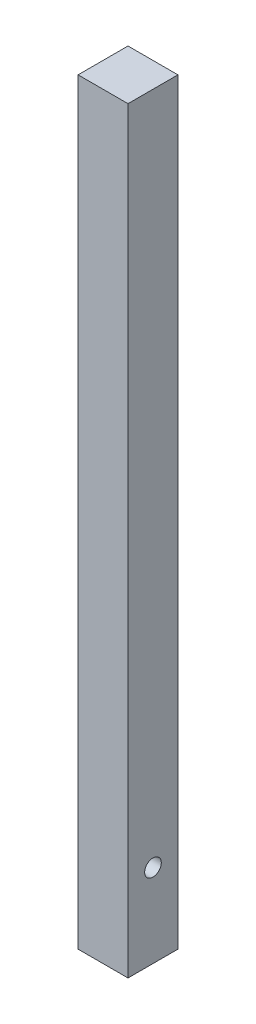
ISO-10303-21;
HEADER;
FILE_DESCRIPTION(('STEP AP214'),'2;1');
FILE_NAME('part.step','',(''),(''),'','','');
FILE_SCHEMA(('AUTOMOTIVE_DESIGN { 1 0 10303 214 1 1 1 1 }'));
ENDSEC;
DATA;
#1=APPLICATION_CONTEXT('core data for automotive mechanical design processes');
#2=APPLICATION_PROTOCOL_DEFINITION('international standard','automotive_design',2000,#1);
#3=PRODUCT_CONTEXT('',#1,'mechanical');
#4=PRODUCT('Part','Part','',(#3));
#5=PRODUCT_RELATED_PRODUCT_CATEGORY('part','',(#4));
#6=PRODUCT_DEFINITION_FORMATION('','',#4);
#7=PRODUCT_DEFINITION_CONTEXT('part definition',#1,'design');
#8=PRODUCT_DEFINITION('design','',#6,#7);
#9=PRODUCT_DEFINITION_SHAPE('','',#8);
#10=(LENGTH_UNIT() NAMED_UNIT(*) SI_UNIT(.MILLI.,.METRE.));
#11=(NAMED_UNIT(*) PLANE_ANGLE_UNIT() SI_UNIT($,.RADIAN.));
#12=(NAMED_UNIT(*) SI_UNIT($,.STERADIAN.) SOLID_ANGLE_UNIT());
#13=UNCERTAINTY_MEASURE_WITH_UNIT(LENGTH_MEASURE(1.E-05),#10,'distance_accuracy_value','');
#14=(GEOMETRIC_REPRESENTATION_CONTEXT(3) GLOBAL_UNCERTAINTY_ASSIGNED_CONTEXT((#13)) GLOBAL_UNIT_ASSIGNED_CONTEXT((#10,
#11,#12)) REPRESENTATION_CONTEXT('',''));
#15=CARTESIAN_POINT('',(0.,0.,0.));
#16=DIRECTION('',(0.,0.,1.));
#17=DIRECTION('',(1.,0.,0.));
#18=AXIS2_PLACEMENT_3D('',#15,#16,#17);
#19=CARTESIAN_POINT('',(19.05,577.85,-19.05));
#20=DIRECTION('',(-1.,0.,0.));
#21=DIRECTION('',(0.,0.,1.));
#22=AXIS2_PLACEMENT_3D('',#19,#20,#21);
#23=PLANE('',#22);
#24=CARTESIAN_POINT('',(19.05,63.5,0.));
#25=DIRECTION('',(1.,0.,0.));
#26=DIRECTION('',(0.,0.,-1.));
#27=AXIS2_PLACEMENT_3D('',#24,#25,#26);
#28=CIRCLE('',#27,6.35);
#29=CARTESIAN_POINT('',(19.05,63.5,-6.35));
#30=VERTEX_POINT('',#29);
#31=EDGE_CURVE('E109',#30,#30,#28,.T.);
#32=ORIENTED_EDGE('',*,*,#31,.F.);
#33=EDGE_LOOP('',(#32));
#34=FACE_BOUND('',#33,.T.);
#35=DIRECTION('',(0.,0.,-1.));
#36=VECTOR('',#35,1.);
#37=CARTESIAN_POINT('',(19.05,0.,-19.05));
#38=LINE('',#37,#36);
#39=CARTESIAN_POINT('',(19.05,0.,19.05));
#40=VERTEX_POINT('',#39);
#41=CARTESIAN_POINT('',(19.05,0.,-19.05));
#42=VERTEX_POINT('',#41);
#43=EDGE_CURVE('E95',#40,#42,#38,.T.);
#44=ORIENTED_EDGE('',*,*,#43,.T.);
#45=DIRECTION('',(0.,-1.,0.));
#46=VECTOR('',#45,1.);
#47=CARTESIAN_POINT('',(19.05,577.85,-19.05));
#48=LINE('',#47,#46);
#49=CARTESIAN_POINT('',(19.05,577.85,-19.05));
#50=VERTEX_POINT('',#49);
#51=EDGE_CURVE('E11',#50,#42,#48,.T.);
#52=ORIENTED_EDGE('',*,*,#51,.F.);
#53=DIRECTION('',(0.,0.,-1.));
#54=VECTOR('',#53,1.);
#55=CARTESIAN_POINT('',(19.05,577.85,-19.05));
#56=LINE('',#55,#54);
#57=CARTESIAN_POINT('',(19.05,577.85,19.05));
#58=VERTEX_POINT('',#57);
#59=EDGE_CURVE('E83',#58,#50,#56,.T.);
#60=ORIENTED_EDGE('',*,*,#59,.F.);
#61=DIRECTION('',(0.,-1.,0.));
#62=VECTOR('',#61,1.);
#63=CARTESIAN_POINT('',(19.05,577.85,19.05));
#64=LINE('',#63,#62);
#65=EDGE_CURVE('E91',#58,#40,#64,.T.);
#66=ORIENTED_EDGE('',*,*,#65,.T.);
#67=EDGE_LOOP('',(#44,#52,#60,#66));
#68=FACE_BOUND('',#67,.T.);
#69=ADVANCED_FACE('F32',(#34,#68),#23,.F.);
#70=CARTESIAN_POINT('',(-19.05,577.85,-19.05));
#71=DIRECTION('',(0.,0.,1.));
#72=DIRECTION('',(1.,0.,0.));
#73=AXIS2_PLACEMENT_3D('',#70,#71,#72);
#74=PLANE('',#73);
#75=CARTESIAN_POINT('',(0.,63.5,-19.05));
#76=DIRECTION('',(0.,0.,-1.));
#77=DIRECTION('',(-1.,0.,0.));
#78=AXIS2_PLACEMENT_3D('',#75,#76,#77);
#79=CIRCLE('',#78,6.35);
#80=CARTESIAN_POINT('',(-6.35,63.5,-19.05));
#81=VERTEX_POINT('',#80);
#82=EDGE_CURVE('E115',#81,#81,#79,.T.);
#83=ORIENTED_EDGE('',*,*,#82,.F.);
#84=EDGE_LOOP('',(#83));
#85=FACE_BOUND('',#84,.T.);
#86=DIRECTION('',(-1.,0.,0.));
#87=VECTOR('',#86,1.);
#88=CARTESIAN_POINT('',(-19.05,0.,-19.05));
#89=LINE('',#88,#87);
#90=CARTESIAN_POINT('',(-19.05,0.,-19.05));
#91=VERTEX_POINT('',#90);
#92=EDGE_CURVE('E87',#42,#91,#89,.T.);
#93=ORIENTED_EDGE('',*,*,#92,.T.);
#94=DIRECTION('',(0.,-1.,0.));
#95=VECTOR('',#94,1.);
#96=CARTESIAN_POINT('',(-19.05,577.85,-19.05));
#97=LINE('',#96,#95);
#98=CARTESIAN_POINT('',(-19.05,577.85,-19.05));
#99=VERTEX_POINT('',#98);
#100=EDGE_CURVE('E40',#99,#91,#97,.T.);
#101=ORIENTED_EDGE('',*,*,#100,.F.);
#102=DIRECTION('',(-1.,0.,0.));
#103=VECTOR('',#102,1.);
#104=CARTESIAN_POINT('',(-19.05,577.85,-19.05));
#105=LINE('',#104,#103);
#106=EDGE_CURVE('E78',#50,#99,#105,.T.);
#107=ORIENTED_EDGE('',*,*,#106,.F.);
#108=ORIENTED_EDGE('',*,*,#51,.T.);
#109=EDGE_LOOP('',(#93,#101,#107,#108));
#110=FACE_BOUND('',#109,.T.);
#111=ADVANCED_FACE('F86',(#85,#110),#74,.F.);
#112=CARTESIAN_POINT('',(-19.05,577.85,-19.05));
#113=DIRECTION('',(1.,0.,0.));
#114=DIRECTION('',(0.,0.,-1.));
#115=AXIS2_PLACEMENT_3D('',#112,#113,#114);
#116=PLANE('',#115);
#117=DIRECTION('',(0.,0.,1.));
#118=VECTOR('',#117,1.);
#119=CARTESIAN_POINT('',(-19.05,0.,-19.05));
#120=LINE('',#119,#118);
#121=CARTESIAN_POINT('',(-19.05,0.,19.05));
#122=VERTEX_POINT('',#121);
#123=EDGE_CURVE('E65',#91,#122,#120,.T.);
#124=ORIENTED_EDGE('',*,*,#123,.T.);
#125=DIRECTION('',(0.,-1.,0.));
#126=VECTOR('',#125,1.);
#127=CARTESIAN_POINT('',(-19.05,577.85,19.05));
#128=LINE('',#127,#126);
#129=CARTESIAN_POINT('',(-19.05,577.85,19.05));
#130=VERTEX_POINT('',#129);
#131=EDGE_CURVE('E88',#130,#122,#128,.T.);
#132=ORIENTED_EDGE('',*,*,#131,.F.);
#133=DIRECTION('',(0.,0.,1.));
#134=VECTOR('',#133,1.);
#135=CARTESIAN_POINT('',(-19.05,577.85,-19.05));
#136=LINE('',#135,#134);
#137=EDGE_CURVE('E81',#99,#130,#136,.T.);
#138=ORIENTED_EDGE('',*,*,#137,.F.);
#139=ORIENTED_EDGE('',*,*,#100,.T.);
#140=EDGE_LOOP('',(#124,#132,#138,#139));
#141=FACE_BOUND('',#140,.T.);
#142=ADVANCED_FACE('F89',(#141),#116,.F.);
#143=CARTESIAN_POINT('',(-19.05,577.85,19.05));
#144=DIRECTION('',(0.,0.,-1.));
#145=DIRECTION('',(-1.,0.,0.));
#146=AXIS2_PLACEMENT_3D('',#143,#144,#145);
#147=PLANE('',#146);
#148=DIRECTION('',(1.,0.,0.));
#149=VECTOR('',#148,1.);
#150=CARTESIAN_POINT('',(-19.05,0.,19.05));
#151=LINE('',#150,#149);
#152=EDGE_CURVE('E71',#122,#40,#151,.T.);
#153=ORIENTED_EDGE('',*,*,#152,.T.);
#154=ORIENTED_EDGE('',*,*,#65,.F.);
#155=DIRECTION('',(1.,0.,0.));
#156=VECTOR('',#155,1.);
#157=CARTESIAN_POINT('',(-19.05,577.85,19.05));
#158=LINE('',#157,#156);
#159=EDGE_CURVE('E48',#130,#58,#158,.T.);
#160=ORIENTED_EDGE('',*,*,#159,.F.);
#161=ORIENTED_EDGE('',*,*,#131,.T.);
#162=EDGE_LOOP('',(#153,#154,#160,#161));
#163=FACE_BOUND('',#162,.T.);
#164=ADVANCED_FACE('F103',(#163),#147,.F.);
#165=CARTESIAN_POINT('',(0.,577.85,0.));
#166=DIRECTION('',(0.,1.,0.));
#167=DIRECTION('',(0.,0.,1.));
#168=AXIS2_PLACEMENT_3D('',#165,#166,#167);
#169=PLANE('',#168);
#170=ORIENTED_EDGE('',*,*,#59,.T.);
#171=ORIENTED_EDGE('',*,*,#106,.T.);
#172=ORIENTED_EDGE('',*,*,#137,.T.);
#173=ORIENTED_EDGE('',*,*,#159,.T.);
#174=EDGE_LOOP('',(#170,#171,#172,#173));
#175=FACE_BOUND('',#174,.T.);
#176=ADVANCED_FACE('F79',(#175),#169,.T.);
#177=CARTESIAN_POINT('',(0.,0.,0.));
#178=DIRECTION('',(0.,1.,0.));
#179=DIRECTION('',(0.,0.,1.));
#180=AXIS2_PLACEMENT_3D('',#177,#178,#179);
#181=PLANE('',#180);
#182=ORIENTED_EDGE('',*,*,#43,.F.);
#183=ORIENTED_EDGE('',*,*,#152,.F.);
#184=ORIENTED_EDGE('',*,*,#123,.F.);
#185=ORIENTED_EDGE('',*,*,#92,.F.);
#186=EDGE_LOOP('',(#182,#183,#184,#185));
#187=FACE_BOUND('',#186,.T.);
#188=ADVANCED_FACE('F106',(#187),#181,.F.);
#189=CARTESIAN_POINT('',(6.35,63.5,0.));
#190=DIRECTION('',(1.,0.,0.));
#191=DIRECTION('',(0.,0.,-1.));
#192=AXIS2_PLACEMENT_3D('',#189,#190,#191);
#193=CYLINDRICAL_SURFACE('',#192,6.35);
#194=CARTESIAN_POINT('',(6.35,63.5,0.));
#195=DIRECTION('',(1.,0.,0.));
#196=DIRECTION('',(0.,0.,-1.));
#197=AXIS2_PLACEMENT_3D('',#194,#195,#196);
#198=CIRCLE('',#197,6.35);
#199=CARTESIAN_POINT('',(6.35,63.5,-6.35));
#200=VERTEX_POINT('',#199);
#201=EDGE_CURVE('E98',#200,#200,#198,.T.);
#202=ORIENTED_EDGE('',*,*,#201,.F.);
#203=EDGE_LOOP('',(#202));
#204=FACE_BOUND('',#203,.T.);
#205=ORIENTED_EDGE('',*,*,#31,.T.);
#206=EDGE_LOOP('',(#205));
#207=FACE_BOUND('',#206,.T.);
#208=ADVANCED_FACE('F142',(#204,#207),#193,.F.);
#209=CARTESIAN_POINT('',(6.35,63.5,0.));
#210=DIRECTION('',(1.,0.,0.));
#211=DIRECTION('',(0.,0.,-1.));
#212=AXIS2_PLACEMENT_3D('',#209,#210,#211);
#213=PLANE('',#212);
#214=ORIENTED_EDGE('',*,*,#201,.T.);
#215=EDGE_LOOP('',(#214));
#216=FACE_BOUND('',#215,.T.);
#217=ADVANCED_FACE('F126',(#216),#213,.T.);
#218=CARTESIAN_POINT('',(0.,63.5,-6.350254));
#219=DIRECTION('',(0.,0.,-1.));
#220=DIRECTION('',(-1.,0.,0.));
#221=AXIS2_PLACEMENT_3D('',#218,#219,#220);
#222=CYLINDRICAL_SURFACE('',#221,6.35);
#223=CARTESIAN_POINT('',(0.,63.5,-6.350254));
#224=DIRECTION('',(0.,0.,-1.));
#225=DIRECTION('',(-1.,0.,0.));
#226=AXIS2_PLACEMENT_3D('',#223,#224,#225);
#227=CIRCLE('',#226,6.35);
#228=CARTESIAN_POINT('',(-6.35,63.5,-6.350254));
#229=VERTEX_POINT('',#228);
#230=EDGE_CURVE('E112',#229,#229,#227,.T.);
#231=ORIENTED_EDGE('',*,*,#230,.F.);
#232=EDGE_LOOP('',(#231));
#233=FACE_BOUND('',#232,.T.);
#234=ORIENTED_EDGE('',*,*,#82,.T.);
#235=EDGE_LOOP('',(#234));
#236=FACE_BOUND('',#235,.T.);
#237=ADVANCED_FACE('F123',(#233,#236),#222,.F.);
#238=CARTESIAN_POINT('',(0.,63.5,-6.350254));
#239=DIRECTION('',(0.,0.,-1.));
#240=DIRECTION('',(-1.,0.,0.));
#241=AXIS2_PLACEMENT_3D('',#238,#239,#240);
#242=PLANE('',#241);
#243=ORIENTED_EDGE('',*,*,#230,.T.);
#244=EDGE_LOOP('',(#243));
#245=FACE_BOUND('',#244,.T.);
#246=ADVANCED_FACE('F121',(#245),#242,.T.);
#247=CLOSED_SHELL('',(#69,#111,#142,#164,#176,#188,#208,#217,#237,#246));
#248=MANIFOLD_SOLID_BREP('B2',#247);
#249=ADVANCED_BREP_SHAPE_REPRESENTATION('',(#18,#248),#14);
#250=SHAPE_DEFINITION_REPRESENTATION(#9,#249);
ENDSEC;
END-ISO-10303-21;
